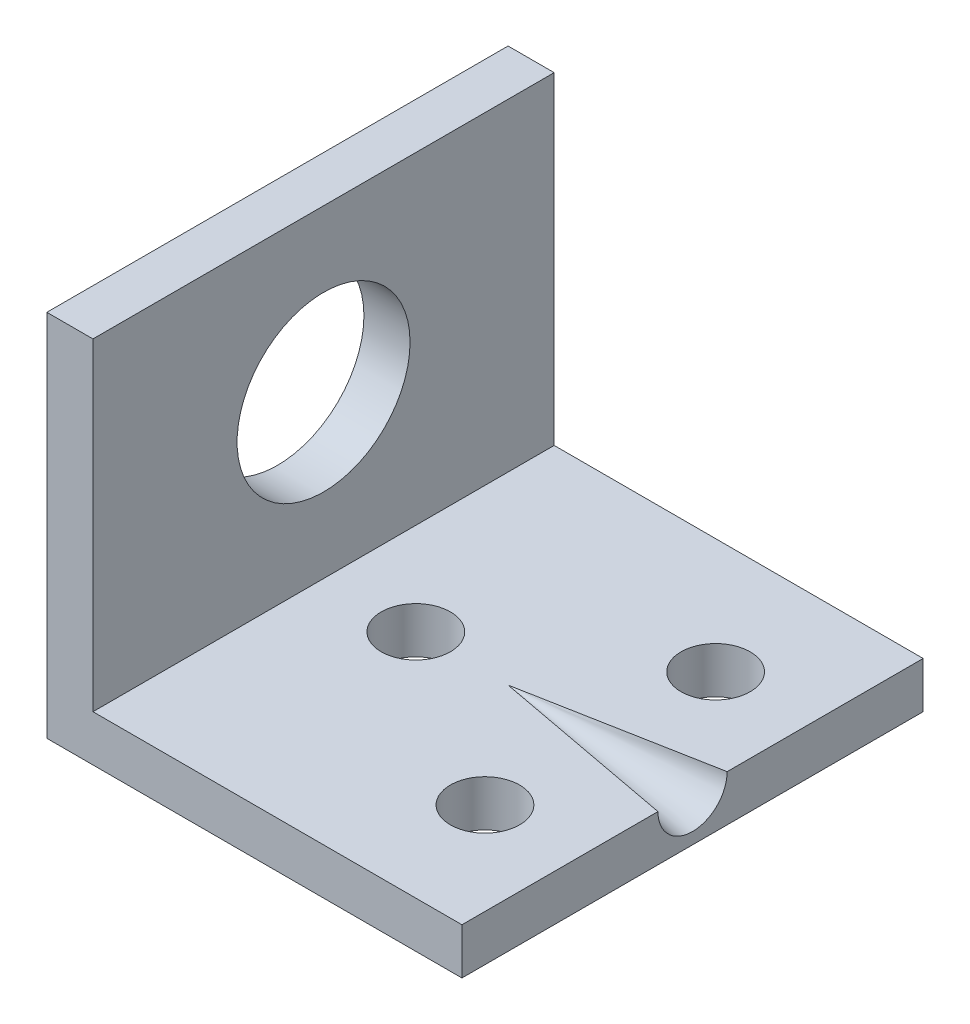
ISO-10303-21;
HEADER;
FILE_DESCRIPTION(('STEP AP214'),'2;1');
FILE_NAME('part.step','',(''),(''),'','','');
FILE_SCHEMA(('AUTOMOTIVE_DESIGN { 1 0 10303 214 1 1 1 1 }'));
ENDSEC;
DATA;
#1=APPLICATION_CONTEXT('core data for automotive mechanical design processes');
#2=APPLICATION_PROTOCOL_DEFINITION('international standard','automotive_design',2000,#1);
#3=PRODUCT_CONTEXT('',#1,'mechanical');
#4=PRODUCT('Part','Part','',(#3));
#5=PRODUCT_RELATED_PRODUCT_CATEGORY('part','',(#4));
#6=PRODUCT_DEFINITION_FORMATION('','',#4);
#7=PRODUCT_DEFINITION_CONTEXT('part definition',#1,'design');
#8=PRODUCT_DEFINITION('design','',#6,#7);
#9=PRODUCT_DEFINITION_SHAPE('','',#8);
#10=(LENGTH_UNIT() NAMED_UNIT(*) SI_UNIT(.MILLI.,.METRE.));
#11=(NAMED_UNIT(*) PLANE_ANGLE_UNIT() SI_UNIT($,.RADIAN.));
#12=(NAMED_UNIT(*) SI_UNIT($,.STERADIAN.) SOLID_ANGLE_UNIT());
#13=UNCERTAINTY_MEASURE_WITH_UNIT(LENGTH_MEASURE(1.E-05),#10,'distance_accuracy_value','');
#14=(GEOMETRIC_REPRESENTATION_CONTEXT(3) GLOBAL_UNCERTAINTY_ASSIGNED_CONTEXT((#13)) GLOBAL_UNIT_ASSIGNED_CONTEXT((#10,
#11,#12)) REPRESENTATION_CONTEXT('',''));
#15=CARTESIAN_POINT('',(0.,0.,0.));
#16=DIRECTION('',(0.,0.,1.));
#17=DIRECTION('',(1.,0.,0.));
#18=AXIS2_PLACEMENT_3D('',#15,#16,#17);
#19=CARTESIAN_POINT('',(0.,2.,0.));
#20=DIRECTION('',(0.,1.,0.));
#21=DIRECTION('',(0.,0.,1.));
#22=AXIS2_PLACEMENT_3D('',#19,#20,#21);
#23=PLANE('',#22);
#24=CARTESIAN_POINT('',(11.,2.,-5.));
#25=DIRECTION('',(0.,1.,0.));
#26=DIRECTION('',(0.,0.,1.));
#27=AXIS2_PLACEMENT_3D('',#24,#25,#26);
#28=CIRCLE('',#27,1.5);
#29=CARTESIAN_POINT('',(11.,2.,-3.5));
#30=VERTEX_POINT('',#29);
#31=EDGE_CURVE('E134',#30,#30,#28,.T.);
#32=ORIENTED_EDGE('',*,*,#31,.F.);
#33=EDGE_LOOP('',(#32));
#34=FACE_BOUND('',#33,.T.);
#35=CARTESIAN_POINT('',(3.,2.,0.));
#36=DIRECTION('',(0.,1.,0.));
#37=DIRECTION('',(0.,0.,1.));
#38=AXIS2_PLACEMENT_3D('',#35,#36,#37);
#39=CIRCLE('',#38,1.5);
#40=CARTESIAN_POINT('',(3.,2.,1.5));
#41=VERTEX_POINT('',#40);
#42=EDGE_CURVE('E168',#41,#41,#39,.T.);
#43=ORIENTED_EDGE('',*,*,#42,.F.);
#44=EDGE_LOOP('',(#43));
#45=FACE_BOUND('',#44,.T.);
#46=CARTESIAN_POINT('',(11.,2.,5.));
#47=DIRECTION('',(0.,1.,0.));
#48=DIRECTION('',(0.,0.,1.));
#49=AXIS2_PLACEMENT_3D('',#46,#47,#48);
#50=CIRCLE('',#49,1.5);
#51=CARTESIAN_POINT('',(11.,2.,6.5));
#52=VERTEX_POINT('',#51);
#53=EDGE_CURVE('E106',#52,#52,#50,.F.);
#54=ORIENTED_EDGE('',*,*,#53,.T.);
#55=EDGE_LOOP('',(#54));
#56=FACE_BOUND('',#55,.T.);
#57=DIRECTION('',(0.,0.,-1.));
#58=VECTOR('',#57,1.);
#59=CARTESIAN_POINT('',(15.,2.,0.));
#60=LINE('',#59,#58);
#61=CARTESIAN_POINT('',(15.,2.,10.));
#62=VERTEX_POINT('',#61);
#63=CARTESIAN_POINT('',(15.,2.,1.5));
#64=VERTEX_POINT('',#63);
#65=EDGE_CURVE('E101',#62,#64,#60,.T.);
#66=ORIENTED_EDGE('',*,*,#65,.T.);
#67=DIRECTION('',(0.982872186934322,0.,0.184288535050185));
#68=VECTOR('',#67,1.);
#69=CARTESIAN_POINT('',(7.,2.,0.));
#70=LINE('',#69,#68);
#71=CARTESIAN_POINT('',(7.,2.,0.));
#72=VERTEX_POINT('',#71);
#73=EDGE_CURVE('E11',#64,#72,#70,.F.);
#74=ORIENTED_EDGE('',*,*,#73,.T.);
#75=DIRECTION('',(-0.982872186934322,0.,0.184288535050185));
#76=VECTOR('',#75,1.);
#77=CARTESIAN_POINT('',(7.,2.,0.));
#78=LINE('',#77,#76);
#79=CARTESIAN_POINT('',(15.,2.,-1.5));
#80=VERTEX_POINT('',#79);
#81=EDGE_CURVE('E45',#72,#80,#78,.F.);
#82=ORIENTED_EDGE('',*,*,#81,.T.);
#83=CARTESIAN_POINT('',(15.,2.,-10.));
#84=VERTEX_POINT('',#83);
#85=EDGE_CURVE('E107',#80,#84,#60,.T.);
#86=ORIENTED_EDGE('',*,*,#85,.T.);
#87=DIRECTION('',(-1.,0.,0.));
#88=VECTOR('',#87,1.);
#89=CARTESIAN_POINT('',(0.,2.,-10.));
#90=LINE('',#89,#88);
#91=CARTESIAN_POINT('',(-1.,2.,-10.));
#92=VERTEX_POINT('',#91);
#93=EDGE_CURVE('E165',#84,#92,#90,.T.);
#94=ORIENTED_EDGE('',*,*,#93,.T.);
#95=DIRECTION('',(0.,0.,-1.));
#96=VECTOR('',#95,1.);
#97=CARTESIAN_POINT('',(-1.,2.,-10.));
#98=LINE('',#97,#96);
#99=CARTESIAN_POINT('',(-1.,2.,10.));
#100=VERTEX_POINT('',#99);
#101=EDGE_CURVE('E60',#100,#92,#98,.T.);
#102=ORIENTED_EDGE('',*,*,#101,.F.);
#103=DIRECTION('',(1.,0.,0.));
#104=VECTOR('',#103,1.);
#105=CARTESIAN_POINT('',(0.,2.,10.));
#106=LINE('',#105,#104);
#107=EDGE_CURVE('E102',#100,#62,#106,.T.);
#108=ORIENTED_EDGE('',*,*,#107,.T.);
#109=EDGE_LOOP('',(#66,#74,#82,#86,#94,#102,#108));
#110=FACE_BOUND('',#109,.T.);
#111=ADVANCED_FACE('F37',(#34,#45,#56,#110),#23,.T.);
#112=CARTESIAN_POINT('',(0.,2.,-10.));
#113=DIRECTION('',(0.,0.,1.));
#114=DIRECTION('',(1.,0.,0.));
#115=AXIS2_PLACEMENT_3D('',#112,#113,#114);
#116=PLANE('',#115);
#117=DIRECTION('',(-1.,0.,0.));
#118=VECTOR('',#117,1.);
#119=CARTESIAN_POINT('',(0.,0.,-10.));
#120=LINE('',#119,#118);
#121=CARTESIAN_POINT('',(15.,0.,-10.));
#122=VERTEX_POINT('',#121);
#123=CARTESIAN_POINT('',(-3.,0.,-10.));
#124=VERTEX_POINT('',#123);
#125=EDGE_CURVE('E122',#122,#124,#120,.T.);
#126=ORIENTED_EDGE('',*,*,#125,.T.);
#127=DIRECTION('',(0.,-1.,0.));
#128=VECTOR('',#127,1.);
#129=CARTESIAN_POINT('',(-3.,2.,-10.));
#130=LINE('',#129,#128);
#131=CARTESIAN_POINT('',(-3.,16.,-10.));
#132=VERTEX_POINT('',#131);
#133=EDGE_CURVE('E98',#132,#124,#130,.T.);
#134=ORIENTED_EDGE('',*,*,#133,.F.);
#135=DIRECTION('',(-1.,0.,0.));
#136=VECTOR('',#135,1.);
#137=CARTESIAN_POINT('',(-3.,16.,-10.));
#138=LINE('',#137,#136);
#139=CARTESIAN_POINT('',(-1.,16.,-10.));
#140=VERTEX_POINT('',#139);
#141=EDGE_CURVE('E177',#140,#132,#138,.T.);
#142=ORIENTED_EDGE('',*,*,#141,.F.);
#143=DIRECTION('',(0.,-1.,0.));
#144=VECTOR('',#143,1.);
#145=CARTESIAN_POINT('',(-1.,16.,-10.));
#146=LINE('',#145,#144);
#147=EDGE_CURVE('E167',#140,#92,#146,.T.);
#148=ORIENTED_EDGE('',*,*,#147,.T.);
#149=ORIENTED_EDGE('',*,*,#93,.F.);
#150=DIRECTION('',(0.,-1.,0.));
#151=VECTOR('',#150,1.);
#152=CARTESIAN_POINT('',(15.,2.,-10.));
#153=LINE('',#152,#151);
#154=EDGE_CURVE('E110',#84,#122,#153,.T.);
#155=ORIENTED_EDGE('',*,*,#154,.T.);
#156=EDGE_LOOP('',(#126,#134,#142,#148,#149,#155));
#157=FACE_BOUND('',#156,.T.);
#158=ADVANCED_FACE('F152',(#157),#116,.F.);
#159=CARTESIAN_POINT('',(-3.,2.,0.));
#160=DIRECTION('',(1.,0.,0.));
#161=DIRECTION('',(0.,0.,-1.));
#162=AXIS2_PLACEMENT_3D('',#159,#160,#161);
#163=PLANE('',#162);
#164=CARTESIAN_POINT('',(-3.,9.,0.));
#165=DIRECTION('',(1.,0.,0.));
#166=DIRECTION('',(0.,0.,-1.));
#167=AXIS2_PLACEMENT_3D('',#164,#165,#166);
#168=CIRCLE('',#167,3.75);
#169=CARTESIAN_POINT('',(-3.,9.,-3.75));
#170=VERTEX_POINT('',#169);
#171=EDGE_CURVE('E179',#170,#170,#168,.T.);
#172=ORIENTED_EDGE('',*,*,#171,.T.);
#173=EDGE_LOOP('',(#172));
#174=FACE_BOUND('',#173,.T.);
#175=DIRECTION('',(0.,0.,1.));
#176=VECTOR('',#175,1.);
#177=CARTESIAN_POINT('',(-3.,0.,0.));
#178=LINE('',#177,#176);
#179=CARTESIAN_POINT('',(-3.,0.,10.));
#180=VERTEX_POINT('',#179);
#181=EDGE_CURVE('E125',#124,#180,#178,.T.);
#182=ORIENTED_EDGE('',*,*,#181,.T.);
#183=DIRECTION('',(0.,-1.,0.));
#184=VECTOR('',#183,1.);
#185=CARTESIAN_POINT('',(-3.,2.,10.));
#186=LINE('',#185,#184);
#187=CARTESIAN_POINT('',(-3.,16.,10.));
#188=VERTEX_POINT('',#187);
#189=EDGE_CURVE('E139',#188,#180,#186,.T.);
#190=ORIENTED_EDGE('',*,*,#189,.F.);
#191=DIRECTION('',(0.,0.,1.));
#192=VECTOR('',#191,1.);
#193=CARTESIAN_POINT('',(-3.,16.,10.));
#194=LINE('',#193,#192);
#195=EDGE_CURVE('E147',#132,#188,#194,.T.);
#196=ORIENTED_EDGE('',*,*,#195,.F.);
#197=ORIENTED_EDGE('',*,*,#133,.T.);
#198=EDGE_LOOP('',(#182,#190,#196,#197));
#199=FACE_BOUND('',#198,.T.);
#200=ADVANCED_FACE('F145',(#174,#199),#163,.F.);
#201=CARTESIAN_POINT('',(0.,2.,10.));
#202=DIRECTION('',(0.,0.,-1.));
#203=DIRECTION('',(-1.,0.,0.));
#204=AXIS2_PLACEMENT_3D('',#201,#202,#203);
#205=PLANE('',#204);
#206=DIRECTION('',(1.,0.,0.));
#207=VECTOR('',#206,1.);
#208=CARTESIAN_POINT('',(0.,0.,10.));
#209=LINE('',#208,#207);
#210=CARTESIAN_POINT('',(15.,0.,10.));
#211=VERTEX_POINT('',#210);
#212=EDGE_CURVE('E127',#180,#211,#209,.T.);
#213=ORIENTED_EDGE('',*,*,#212,.T.);
#214=DIRECTION('',(0.,-1.,0.));
#215=VECTOR('',#214,1.);
#216=CARTESIAN_POINT('',(15.,2.,10.));
#217=LINE('',#216,#215);
#218=EDGE_CURVE('E137',#62,#211,#217,.T.);
#219=ORIENTED_EDGE('',*,*,#218,.F.);
#220=ORIENTED_EDGE('',*,*,#107,.F.);
#221=DIRECTION('',(0.,-1.,0.));
#222=VECTOR('',#221,1.);
#223=CARTESIAN_POINT('',(-1.,16.,10.));
#224=LINE('',#223,#222);
#225=CARTESIAN_POINT('',(-1.,16.,10.));
#226=VERTEX_POINT('',#225);
#227=EDGE_CURVE('E119',#226,#100,#224,.T.);
#228=ORIENTED_EDGE('',*,*,#227,.F.);
#229=DIRECTION('',(1.,0.,0.));
#230=VECTOR('',#229,1.);
#231=CARTESIAN_POINT('',(-1.,16.,10.));
#232=LINE('',#231,#230);
#233=EDGE_CURVE('E183',#188,#226,#232,.T.);
#234=ORIENTED_EDGE('',*,*,#233,.F.);
#235=ORIENTED_EDGE('',*,*,#189,.T.);
#236=EDGE_LOOP('',(#213,#219,#220,#228,#234,#235));
#237=FACE_BOUND('',#236,.T.);
#238=ADVANCED_FACE('F161',(#237),#205,.F.);
#239=CARTESIAN_POINT('',(15.,2.,0.));
#240=DIRECTION('',(-1.,0.,0.));
#241=DIRECTION('',(0.,0.,1.));
#242=AXIS2_PLACEMENT_3D('',#239,#240,#241);
#243=PLANE('',#242);
#244=CARTESIAN_POINT('',(15.,2.,0.));
#245=DIRECTION('',(-1.,0.,0.));
#246=DIRECTION('',(0.,0.,1.));
#247=AXIS2_PLACEMENT_3D('',#244,#245,#246);
#248=CIRCLE('',#247,1.5);
#249=EDGE_CURVE('E52',#80,#64,#248,.T.);
#250=ORIENTED_EDGE('',*,*,#249,.T.);
#251=ORIENTED_EDGE('',*,*,#65,.F.);
#252=ORIENTED_EDGE('',*,*,#218,.T.);
#253=DIRECTION('',(0.,0.,-1.));
#254=VECTOR('',#253,1.);
#255=CARTESIAN_POINT('',(15.,0.,0.));
#256=LINE('',#255,#254);
#257=EDGE_CURVE('E129',#211,#122,#256,.T.);
#258=ORIENTED_EDGE('',*,*,#257,.T.);
#259=ORIENTED_EDGE('',*,*,#154,.F.);
#260=ORIENTED_EDGE('',*,*,#85,.F.);
#261=EDGE_LOOP('',(#250,#251,#252,#258,#259,#260));
#262=FACE_BOUND('',#261,.T.);
#263=ADVANCED_FACE('F163',(#262),#243,.F.);
#264=CARTESIAN_POINT('',(3.,2.,0.));
#265=DIRECTION('',(0.,-1.,0.));
#266=DIRECTION('',(0.,0.,-1.));
#267=AXIS2_PLACEMENT_3D('',#264,#265,#266);
#268=CYLINDRICAL_SURFACE('',#267,1.5);
#269=ORIENTED_EDGE('',*,*,#42,.T.);
#270=EDGE_LOOP('',(#269));
#271=FACE_BOUND('',#270,.T.);
#272=CARTESIAN_POINT('',(3.,0.,0.));
#273=DIRECTION('',(0.,1.,0.));
#274=DIRECTION('',(0.,0.,1.));
#275=AXIS2_PLACEMENT_3D('',#272,#273,#274);
#276=CIRCLE('',#275,1.5);
#277=CARTESIAN_POINT('',(3.,0.,1.5));
#278=VERTEX_POINT('',#277);
#279=EDGE_CURVE('E118',#278,#278,#276,.T.);
#280=ORIENTED_EDGE('',*,*,#279,.F.);
#281=EDGE_LOOP('',(#280));
#282=FACE_BOUND('',#281,.T.);
#283=ADVANCED_FACE('F230',(#271,#282),#268,.F.);
#284=CARTESIAN_POINT('',(11.,2.,-5.));
#285=DIRECTION('',(0.,-1.,0.));
#286=DIRECTION('',(0.,0.,-1.));
#287=AXIS2_PLACEMENT_3D('',#284,#285,#286);
#288=CYLINDRICAL_SURFACE('',#287,1.5);
#289=ORIENTED_EDGE('',*,*,#31,.T.);
#290=EDGE_LOOP('',(#289));
#291=FACE_BOUND('',#290,.T.);
#292=CARTESIAN_POINT('',(11.,0.,-5.));
#293=DIRECTION('',(0.,1.,0.));
#294=DIRECTION('',(0.,0.,1.));
#295=AXIS2_PLACEMENT_3D('',#292,#293,#294);
#296=CIRCLE('',#295,1.5);
#297=CARTESIAN_POINT('',(11.,0.,-3.5));
#298=VERTEX_POINT('',#297);
#299=EDGE_CURVE('E115',#298,#298,#296,.T.);
#300=ORIENTED_EDGE('',*,*,#299,.F.);
#301=EDGE_LOOP('',(#300));
#302=FACE_BOUND('',#301,.T.);
#303=ADVANCED_FACE('F39',(#291,#302),#288,.F.);
#304=CARTESIAN_POINT('',(11.,2.,5.));
#305=DIRECTION('',(0.,-1.,0.));
#306=DIRECTION('',(0.,0.,-1.));
#307=AXIS2_PLACEMENT_3D('',#304,#305,#306);
#308=CYLINDRICAL_SURFACE('',#307,1.5);
#309=ORIENTED_EDGE('',*,*,#53,.F.);
#310=EDGE_LOOP('',(#309));
#311=FACE_BOUND('',#310,.T.);
#312=CARTESIAN_POINT('',(11.,0.,5.));
#313=DIRECTION('',(0.,1.,0.));
#314=DIRECTION('',(0.,0.,1.));
#315=AXIS2_PLACEMENT_3D('',#312,#313,#314);
#316=CIRCLE('',#315,1.5);
#317=CARTESIAN_POINT('',(11.,0.,6.5));
#318=VERTEX_POINT('',#317);
#319=EDGE_CURVE('E131',#318,#318,#316,.F.);
#320=ORIENTED_EDGE('',*,*,#319,.T.);
#321=EDGE_LOOP('',(#320));
#322=FACE_BOUND('',#321,.T.);
#323=ADVANCED_FACE('F224',(#311,#322),#308,.F.);
#324=CARTESIAN_POINT('',(0.,0.,0.));
#325=DIRECTION('',(0.,1.,0.));
#326=DIRECTION('',(0.,0.,1.));
#327=AXIS2_PLACEMENT_3D('',#324,#325,#326);
#328=PLANE('',#327);
#329=ORIENTED_EDGE('',*,*,#299,.T.);
#330=EDGE_LOOP('',(#329));
#331=FACE_BOUND('',#330,.T.);
#332=ORIENTED_EDGE('',*,*,#279,.T.);
#333=EDGE_LOOP('',(#332));
#334=FACE_BOUND('',#333,.T.);
#335=ORIENTED_EDGE('',*,*,#125,.F.);
#336=ORIENTED_EDGE('',*,*,#257,.F.);
#337=ORIENTED_EDGE('',*,*,#212,.F.);
#338=ORIENTED_EDGE('',*,*,#181,.F.);
#339=EDGE_LOOP('',(#335,#336,#337,#338));
#340=FACE_BOUND('',#339,.T.);
#341=ORIENTED_EDGE('',*,*,#319,.F.);
#342=EDGE_LOOP('',(#341));
#343=FACE_BOUND('',#342,.T.);
#344=ADVANCED_FACE('F157',(#331,#334,#340,#343),#328,.F.);
#345=CARTESIAN_POINT('',(-1.,16.,-10.));
#346=DIRECTION('',(-1.,0.,0.));
#347=DIRECTION('',(0.,0.,1.));
#348=AXIS2_PLACEMENT_3D('',#345,#346,#347);
#349=PLANE('',#348);
#350=CARTESIAN_POINT('',(-1.,9.,0.));
#351=DIRECTION('',(1.,0.,0.));
#352=DIRECTION('',(0.,0.,-1.));
#353=AXIS2_PLACEMENT_3D('',#350,#351,#352);
#354=CIRCLE('',#353,3.75);
#355=CARTESIAN_POINT('',(-1.,9.,-3.75));
#356=VERTEX_POINT('',#355);
#357=EDGE_CURVE('E188',#356,#356,#354,.T.);
#358=ORIENTED_EDGE('',*,*,#357,.F.);
#359=EDGE_LOOP('',(#358));
#360=FACE_BOUND('',#359,.T.);
#361=ORIENTED_EDGE('',*,*,#101,.T.);
#362=ORIENTED_EDGE('',*,*,#147,.F.);
#363=DIRECTION('',(0.,0.,-1.));
#364=VECTOR('',#363,1.);
#365=CARTESIAN_POINT('',(-1.,16.,-10.));
#366=LINE('',#365,#364);
#367=EDGE_CURVE('E181',#226,#140,#366,.T.);
#368=ORIENTED_EDGE('',*,*,#367,.F.);
#369=ORIENTED_EDGE('',*,*,#227,.T.);
#370=EDGE_LOOP('',(#361,#362,#368,#369));
#371=FACE_BOUND('',#370,.T.);
#372=ADVANCED_FACE('F196',(#360,#371),#349,.F.);
#373=CARTESIAN_POINT('',(0.,16.,0.));
#374=DIRECTION('',(0.,-1.,0.));
#375=DIRECTION('',(0.,0.,-1.));
#376=AXIS2_PLACEMENT_3D('',#373,#374,#375);
#377=PLANE('',#376);
#378=ORIENTED_EDGE('',*,*,#195,.T.);
#379=ORIENTED_EDGE('',*,*,#233,.T.);
#380=ORIENTED_EDGE('',*,*,#367,.T.);
#381=ORIENTED_EDGE('',*,*,#141,.T.);
#382=EDGE_LOOP('',(#378,#379,#380,#381));
#383=FACE_BOUND('',#382,.T.);
#384=ADVANCED_FACE('F199',(#383),#377,.F.);
#385=CARTESIAN_POINT('',(-11.,9.,0.));
#386=DIRECTION('',(1.,0.,0.));
#387=DIRECTION('',(0.,0.,-1.));
#388=AXIS2_PLACEMENT_3D('',#385,#386,#387);
#389=CYLINDRICAL_SURFACE('',#388,3.75);
#390=ORIENTED_EDGE('',*,*,#357,.T.);
#391=EDGE_LOOP('',(#390));
#392=FACE_BOUND('',#391,.T.);
#393=ORIENTED_EDGE('',*,*,#171,.F.);
#394=EDGE_LOOP('',(#393));
#395=FACE_BOUND('',#394,.T.);
#396=ADVANCED_FACE('F193',(#392,#395),#389,.F.);
#397=CARTESIAN_POINT('',(15.,2.,0.));
#398=DIRECTION('',(1.,0.,0.));
#399=DIRECTION('',(0.,0.,-1.));
#400=AXIS2_PLACEMENT_3D('',#397,#398,#399);
#401=CONICAL_SURFACE('',#400,1.5,0.185347949995695);
#402=ORIENTED_EDGE('',*,*,#249,.F.);
#403=ORIENTED_EDGE('',*,*,#81,.F.);
#404=ORIENTED_EDGE('',*,*,#73,.F.);
#405=EDGE_LOOP('',(#402,#403,#404));
#406=FACE_BOUND('',#405,.T.);
#407=ADVANCED_FACE('F96',(#406),#401,.F.);
#408=CLOSED_SHELL('',(#111,#158,#200,#238,#263,#283,#303,#323,#344,#372,#384,#396,#407));
#409=MANIFOLD_SOLID_BREP('B2',#408);
#410=ADVANCED_BREP_SHAPE_REPRESENTATION('',(#18,#409),#14);
#411=SHAPE_DEFINITION_REPRESENTATION(#9,#410);
ENDSEC;
END-ISO-10303-21;
